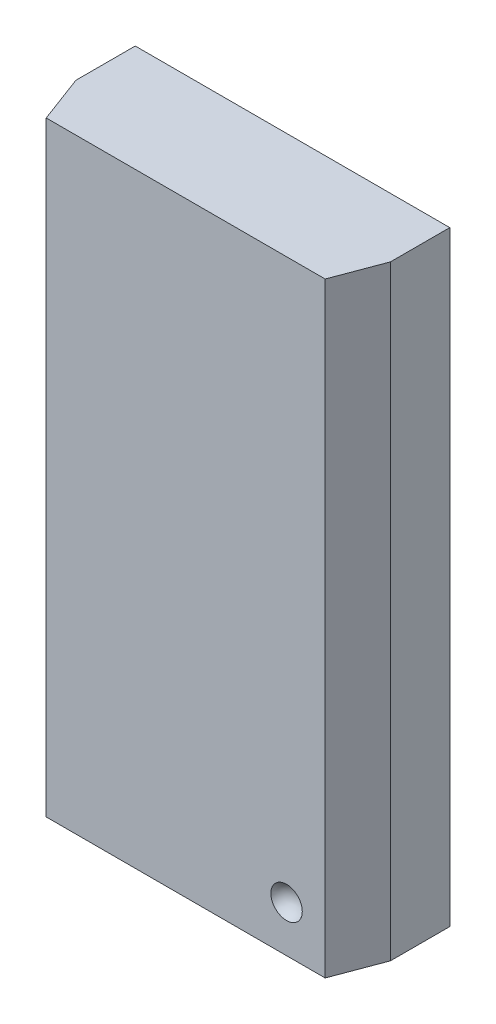
ISO-10303-21;
HEADER;
FILE_DESCRIPTION(('STEP AP214'),'2;1');
FILE_NAME('part.step','',(''),(''),'','','');
FILE_SCHEMA(('AUTOMOTIVE_DESIGN { 1 0 10303 214 1 1 1 1 }'));
ENDSEC;
DATA;
#1=APPLICATION_CONTEXT('core data for automotive mechanical design processes');
#2=APPLICATION_PROTOCOL_DEFINITION('international standard','automotive_design',2000,#1);
#3=PRODUCT_CONTEXT('',#1,'mechanical');
#4=PRODUCT('Part','Part','',(#3));
#5=PRODUCT_RELATED_PRODUCT_CATEGORY('part','',(#4));
#6=PRODUCT_DEFINITION_FORMATION('','',#4);
#7=PRODUCT_DEFINITION_CONTEXT('part definition',#1,'design');
#8=PRODUCT_DEFINITION('design','',#6,#7);
#9=PRODUCT_DEFINITION_SHAPE('','',#8);
#10=(LENGTH_UNIT() NAMED_UNIT(*) SI_UNIT(.MILLI.,.METRE.));
#11=(NAMED_UNIT(*) PLANE_ANGLE_UNIT() SI_UNIT($,.RADIAN.));
#12=(NAMED_UNIT(*) SI_UNIT($,.STERADIAN.) SOLID_ANGLE_UNIT());
#13=UNCERTAINTY_MEASURE_WITH_UNIT(LENGTH_MEASURE(1.E-05),#10,'distance_accuracy_value','');
#14=(GEOMETRIC_REPRESENTATION_CONTEXT(3) GLOBAL_UNCERTAINTY_ASSIGNED_CONTEXT((#13)) GLOBAL_UNIT_ASSIGNED_CONTEXT((#10,
#11,#12)) REPRESENTATION_CONTEXT('',''));
#15=CARTESIAN_POINT('',(0.,0.,0.));
#16=DIRECTION('',(0.,0.,1.));
#17=DIRECTION('',(1.,0.,0.));
#18=AXIS2_PLACEMENT_3D('',#15,#16,#17);
#19=CARTESIAN_POINT('',(1.59694277202488,-4.58817753292736,1.87268785101428));
#20=CARTESIAN_POINT('',(1.64216718875779,-4.58817753292736,1.76585007048859));
#21=CARTESIAN_POINT('',(1.75818245081433,-4.58817753292736,1.7659849276044));
#22=CARTESIAN_POINT('',(1.8031583674009,-4.58817753292736,1.87292755775573));
#23=CARTESIAN_POINT('',(1.34005004997247,-4.47097835084961,1.76394519967328));
#24=CARTESIAN_POINT('',(1.49800623473388,-4.47097835084961,1.39079084148934));
#25=CARTESIAN_POINT('',(1.90321495808281,-4.47097835084961,1.39126185951542));
#26=CARTESIAN_POINT('',(2.06030320163315,-4.47097835084961,1.764782427991));
#27=CARTESIAN_POINT('',(1.34156158465533,-4.16840308910263,1.76458503208151));
#28=CARTESIAN_POINT('',(1.498854465389,-4.16840308910263,1.39299765773633));
#29=CARTESIAN_POINT('',(1.90236159928336,-4.16840308910263,1.39346669782052));
#30=CARTESIAN_POINT('',(2.05879018354391,-4.16840308910263,1.76541874463367));
#31=CARTESIAN_POINT('',(1.59961010586653,-4.05423726383752,1.87381693303589));
#32=CARTESIAN_POINT('',(1.64366402131981,-4.05423726383752,1.76974433485755));
#33=CARTESIAN_POINT('',(1.75667656885828,-4.05423726383752,1.76987570159276));
#34=CARTESIAN_POINT('',(1.80048841586208,-4.05423726383752,1.87405043567195));
#35=(BOUNDED_SURFACE() B_SPLINE_SURFACE(3,3,((#19,#20,#21,#22),(#23,#24,#25,#26),(#27,#28,#29,
#30),(#31,#32,#33,#34)),.UNSPECIFIED.,.F.,.F.,.F.) B_SPLINE_SURFACE_WITH_KNOTS((4,4),(4,4),(0.,
1.),(0.,1.),.UNSPECIFIED.) GEOMETRIC_REPRESENTATION_ITEM() RATIONAL_B_SPLINE_SURFACE(((1.,
0.592495595609752,0.592495595609752,1.),(0.588217584838267,0.348516328276879,0.348516328276879,
0.588217584838267),(0.588217584838267,0.348516328276879,0.348516328276879,0.588217584838267),
(1.,0.592495595609752,0.592495595609752,1.))) REPRESENTATION_ITEM('') SURFACE());
#36=CARTESIAN_POINT('',(1.96447842560012,-4.32171313154078,1.80000000000028));
#37=CARTESIAN_POINT('',(1.96447728753263,-4.31838963170653,1.80000001262232));
#38=CARTESIAN_POINT('',(1.96441451224342,-4.315066139045,1.80000245878868));
#39=CARTESIAN_POINT('',(1.96416669474467,-4.3084576558505,1.8000110646047));
#40=CARTESIAN_POINT('',(1.96398290552865,-4.30517261821554,1.80001718614244));
#41=CARTESIAN_POINT('',(1.9634966485052,-4.29864656048071,1.80003195548272));
#42=CARTESIAN_POINT('',(1.9631954669972,-4.29540544451496,1.80004057565314));
#43=CARTESIAN_POINT('',(1.96247839642698,-4.2889723613424,1.80005930785607));
#44=CARTESIAN_POINT('',(1.96206381806036,-4.28578024798487,1.8000694022622));
#45=CARTESIAN_POINT('',(1.96112419202656,-4.27944988685185,1.80009017662881));
#46=CARTESIAN_POINT('',(1.9606004714086,-4.27631144207713,1.80010084850801));
#47=CARTESIAN_POINT('',(1.95944703881737,-4.27009271396852,1.80012200407324));
#48=CARTESIAN_POINT('',(1.95881866225767,-4.26701218294202,1.80013248848755));
#49=CARTESIAN_POINT('',(1.95746058554247,-4.26091315063053,1.80015262353895));
#50=CARTESIAN_POINT('',(1.95673222157607,-4.25789435183175,1.80016228281985));
#51=CARTESIAN_POINT('',(1.95517898520179,-4.25192222399201,1.80018024710359));
#52=CARTESIAN_POINT('',(1.95435544258135,-4.24896854912622,1.80018856761889));
#53=CARTESIAN_POINT('',(1.95261676925393,-4.24312968404578,1.80020345465584));
#54=CARTESIAN_POINT('',(1.95170295525224,-4.24024410177595,1.80021004239447));
#55=CARTESIAN_POINT('',(1.94978872518747,-4.23454401874528,1.80022118025014));
#56=CARTESIAN_POINT('',(1.94878960661037,-4.23172908227304,1.80022575603369));
#57=CARTESIAN_POINT('',(1.94670978201727,-4.22617248013593,1.80023269727542));
#58=CARTESIAN_POINT('',(1.94563034871328,-4.223430338093,1.80023509153108));
#59=CARTESIAN_POINT('',(1.94339490367646,-4.21802112001746,1.80023760246911));
#60=CARTESIAN_POINT('',(1.94224013493323,-4.21535353026608,1.80023774972271));
#61=CARTESIAN_POINT('',(1.93985899118724,-4.21009483384692,1.80023579918783));
#62=CARTESIAN_POINT('',(1.93863382512152,-4.20750317970491,1.80023373237143));
#63=CARTESIAN_POINT('',(1.93611679404825,-4.20239741159925,1.80022748021666));
#64=CARTESIAN_POINT('',(1.93482610021238,-4.1998827201745,1.8002233248835));
#65=CARTESIAN_POINT('',(1.93218283093036,-4.19493159408113,1.80021311041599));
#66=CARTESIAN_POINT('',(1.93083138578946,-4.19249455585088,1.80020707897545));
#67=CARTESIAN_POINT('',(1.92807132043073,-4.18769913420764,1.80019340941177));
#68=CARTESIAN_POINT('',(1.92666378712757,-4.18534012505309,1.80018579536664));
#69=CARTESIAN_POINT('',(1.9237961193707,-4.18070085929119,1.80016933471427));
#70=CARTESIAN_POINT('',(1.92233702652648,-4.17841995872413,1.80016050731443));
#71=CARTESIAN_POINT('',(1.91937067737575,-4.17393674337793,1.80014206485633));
#72=CARTESIAN_POINT('',(1.91786441582027,-4.17173377012607,1.80013246295508));
#73=CARTESIAN_POINT('',(1.91480797477914,-4.16740595164748,1.80011298488993));
#74=CARTESIAN_POINT('',(1.91325874274912,-4.16528043773412,1.80010311468349));
#75=CARTESIAN_POINT('',(1.91012056268004,-4.1611069910638,1.80008366639348));
#76=CARTESIAN_POINT('',(1.90853251253924,-4.15905838097272,1.80007408614963));
#77=CARTESIAN_POINT('',(1.9037492055295,-4.15307090281385,1.80004696250654));
#78=CARTESIAN_POINT('',(1.9004697469792,-4.14919853952155,1.80003056866547));
#79=CARTESIAN_POINT('',(1.89542693363786,-4.14357575552709,1.80001255333211));
#80=CARTESIAN_POINT('',(1.89374471934441,-4.14175171156943,1.80000766344338));
#81=CARTESIAN_POINT('',(1.89035527492868,-4.13817637272944,1.80000160317097));
#82=CARTESIAN_POINT('',(1.88864875193605,-4.13642440902473,1.80000038033407));
#83=CARTESIAN_POINT('',(1.88451028580023,-4.13229075578714,1.79999947064995));
#84=CARTESIAN_POINT('',(1.88205608843532,-4.12993128092376,1.80000057332496));
#85=CARTESIAN_POINT('',(1.87713750802628,-4.12538265832802,1.80000155337605));
#86=CARTESIAN_POINT('',(1.87467592457072,-4.12319048093511,1.80000146855918));
#87=CARTESIAN_POINT('',(1.86975121609557,-4.1189673874296,1.80000084045628));
#88=CARTESIAN_POINT('',(1.86729058158533,-4.11693356685693,1.80000031169454));
#89=CARTESIAN_POINT('',(1.86237476376204,-4.11301854762314,1.799998336808));
#90=CARTESIAN_POINT('',(1.85992179402098,-4.1111345689952,1.7999969197449));
#91=CARTESIAN_POINT('',(1.85502719520591,-4.10751052695507,1.79999318183108));
#92=CARTESIAN_POINT('',(1.85258752102228,-4.10576782278098,1.79999088999917));
#93=CARTESIAN_POINT('',(1.84772427137791,-4.10241780085942,1.79998544213194));
#94=CARTESIAN_POINT('',(1.84530241379946,-4.10080798874107,1.79998231412484));
#95=CARTESIAN_POINT('',(1.84047854357534,-4.0977154315357,1.79997536888789));
#96=CARTESIAN_POINT('',(1.83807803203342,-4.0962303444771,1.79997157456206));
#97=CARTESIAN_POINT('',(1.83329966578405,-4.09337919888772,1.79996356439305));
#98=CARTESIAN_POINT('',(1.83092311512417,-4.09201095432036,1.79995936364479));
#99=CARTESIAN_POINT('',(1.8261946398181,-4.08938575800985,1.79995095309825));
#100=CARTESIAN_POINT('',(1.82384384070561,-4.08812677859218,1.79994674673807));
#101=CARTESIAN_POINT('',(1.81916805227835,-4.08571277592795,1.79993872977672));
#102=CARTESIAN_POINT('',(1.81684402807039,-4.08455588263353,1.79993491164497));
#103=CARTESIAN_POINT('',(1.81222234094477,-4.08233890350286,1.79992863276084));
#104=CARTESIAN_POINT('',(1.80992549767243,-4.08127710937289,1.79992614012346));
#105=CARTESIAN_POINT('',(1.80535788353773,-4.07924421318437,1.79992204544429));
#106=CARTESIAN_POINT('',(1.80308780760194,-4.07827154720477,1.79992042348522));
#107=CARTESIAN_POINT('',(1.79767722141134,-4.07603892870223,1.79992395033207));
#108=CARTESIAN_POINT('',(1.79452555793486,-4.07480590976565,1.79993182768706));
#109=CARTESIAN_POINT('',(1.78832135571542,-4.07250902178397,1.79995986005971));
#110=CARTESIAN_POINT('',(1.78527070095982,-4.07144004977876,1.79997944928028));
#111=CARTESIAN_POINT('',(1.77926114532082,-4.06945481262306,1.80002289724225));
#112=CARTESIAN_POINT('',(1.77630373527828,-4.06853403365823,1.80004654343802));
#113=CARTESIAN_POINT('',(1.77047155045215,-4.06682990116505,1.80009308249294));
#114=CARTESIAN_POINT('',(1.76759791445186,-4.06604265108598,1.80011596977191));
#115=CARTESIAN_POINT('',(1.76192214840442,-4.06459236489603,1.80015653783994));
#116=CARTESIAN_POINT('',(1.75912085918034,-4.06392604443716,1.80017436770419));
#117=CARTESIAN_POINT('',(1.75357701922797,-4.06270611670374,1.8002017691248));
#118=CARTESIAN_POINT('',(1.75083505524894,-4.06214984915314,1.80021156051204));
#119=CARTESIAN_POINT('',(1.74539565653581,-4.06114019875331,1.80022126659007));
#120=CARTESIAN_POINT('',(1.74269859786264,-4.06068479268409,1.80022139732943));
#121=CARTESIAN_POINT('',(1.73733362606573,-4.05986859977837,1.80021183660787));
#122=CARTESIAN_POINT('',(1.73466592169933,-4.05950643744284,1.80020229959591));
#123=CARTESIAN_POINT('',(1.72934330190236,-4.05886996706827,1.80017528499996));
#124=CARTESIAN_POINT('',(1.72668847319052,-4.05859493174945,1.80015787626315));
#125=CARTESIAN_POINT('',(1.72137479716266,-4.05812736678646,1.80011903670423));
#126=CARTESIAN_POINT('',(1.71871595796997,-4.05793474269773,1.80009761052691));
#127=CARTESIAN_POINT('',(1.71066270682943,-4.05747230425462,1.80003575752337));
#128=CARTESIAN_POINT('',(1.70526059375794,-4.05732607517216,1.79999839177467));
#129=CARTESIAN_POINT('',(1.69714409821811,-4.05732929088231,1.80000080856573));
#130=CARTESIAN_POINT('',(1.69442890419356,-4.0573678709316,1.80001146884006));
#131=CARTESIAN_POINT('',(1.68903582681769,-4.05752354232483,1.80004183839399));
#132=CARTESIAN_POINT('',(1.68635791544734,-4.05763961093691,1.8000614287551));
#133=CARTESIAN_POINT('',(1.68102228660717,-4.05795167921069,1.80010164870628));
#134=CARTESIAN_POINT('',(1.67836454181789,-4.05814721347308,1.80012227164261));
#135=CARTESIAN_POINT('',(1.67305176164835,-4.05862101435347,1.80015873061526));
#136=CARTESIAN_POINT('',(1.67039673878764,-4.05889942266967,1.80017455835846));
#137=CARTESIAN_POINT('',(1.66507221024387,-4.05954309771667,1.80019791781358));
#138=CARTESIAN_POINT('',(1.66240279857298,-4.05990914596882,1.80020537123295));
#139=CARTESIAN_POINT('',(1.65703284961224,-4.06073365587095,1.80021049151079));
#140=CARTESIAN_POINT('',(1.6543325323709,-4.06119355231965,1.80020799365786));
#141=CARTESIAN_POINT('',(1.64888499593244,-4.06221282384361,1.80019351148227));
#142=CARTESIAN_POINT('',(1.64613816767734,-4.06277428452413,1.80018130538614));
#143=CARTESIAN_POINT('',(1.64058295767311,-4.06400535291193,1.80014925564922));
#144=CARTESIAN_POINT('',(1.63777518124051,-4.06467768503301,1.80012919522766));
#145=CARTESIAN_POINT('',(1.63208480150131,-4.06614088111347,1.80008456447886));
#146=CARTESIAN_POINT('',(1.62920306110645,-4.06693509465666,1.80005985980988));
#147=CARTESIAN_POINT('',(1.62335305577725,-4.06865418640755,1.80001031015964));
#148=CARTESIAN_POINT('',(1.62038595530577,-4.06958302727127,1.79998549928012));
#149=CARTESIAN_POINT('',(1.61435547054442,-4.07158560234113,1.79994052693302));
#150=CARTESIAN_POINT('',(1.61129360726477,-4.07266391865996,1.79992061861967));
#151=CARTESIAN_POINT('',(1.60506550193075,-4.07498083763565,1.79989311314443));
#152=CARTESIAN_POINT('',(1.60190117780547,-4.07622461082871,1.79988614320591));
#153=CARTESIAN_POINT('',(1.59648540020566,-4.07846973472313,1.79988483599233));
#154=CARTESIAN_POINT('',(1.59422248717997,-4.07944354301104,1.79988754888633));
#155=CARTESIAN_POINT('',(1.58966967613673,-4.08147828097116,1.79989376927941));
#156=CARTESIAN_POINT('',(1.58738046818964,-4.0825407572344,1.79989729456166));
#157=CARTESIAN_POINT('',(1.58277454746101,-4.08475854376306,1.79990567981732));
#158=CARTESIAN_POINT('',(1.58045864732798,-4.08591554128294,1.79991057185992));
#159=CARTESIAN_POINT('',(1.57579963494365,-4.08832912603591,1.79992074365444));
#160=CARTESIAN_POINT('',(1.5734574788928,-4.08958755973857,1.79992603031154));
#161=CARTESIAN_POINT('',(1.56874683390395,-4.09221094549689,1.79993660896536));
#162=CARTESIAN_POINT('',(1.5663794591953,-4.09357789867174,1.79994189692444));
#163=CARTESIAN_POINT('',(1.56161999585176,-4.09642564508946,1.79995207839219));
#164=CARTESIAN_POINT('',(1.55922919723553,-4.09790859488301,1.79995695591667));
#165=CARTESIAN_POINT('',(1.55442529737623,-4.10099595441502,1.79996605547793));
#166=CARTESIAN_POINT('',(1.55201368006104,-4.1026026736421,1.79997025345021));
#167=CARTESIAN_POINT('',(1.54717143443027,-4.10594547226463,1.7999778184759));
#168=CARTESIAN_POINT('',(1.54474250322951,-4.10768401055478,1.79998115599757));
#169=CARTESIAN_POINT('',(1.5398698762256,-4.11129856183645,1.799986950636));
#170=CARTESIAN_POINT('',(1.5374281104735,-4.11317717716404,1.79998937682664));
#171=CARTESIAN_POINT('',(1.5325351297735,-4.11708018295801,1.79999332326076));
#172=CARTESIAN_POINT('',(1.53008609896134,-4.11910731209517,1.79999481212983));
#173=CARTESIAN_POINT('',(1.5251849503557,-4.12331560548431,1.79999729563158));
#174=CARTESIAN_POINT('',(1.52273528856143,-4.12549963028503,1.79999827274461));
#175=CARTESIAN_POINT('',(1.5178407995044,-4.13003039083344,1.79999901095117));
#176=CARTESIAN_POINT('',(1.51539873148983,-4.13238010964625,1.79999873137773));
#177=CARTESIAN_POINT('',(1.51127326241243,-4.13650347924656,1.80000091530177));
#178=CARTESIAN_POINT('',(1.50956798925599,-4.13825531018738,1.80000263651959));
#179=CARTESIAN_POINT('',(1.50618103220596,-4.14183039596865,1.80000960561245));
#180=CARTESIAN_POINT('',(1.50450005663239,-4.1436543202939,1.80001490462973));
#181=CARTESIAN_POINT('',(1.49946089847525,-4.14927683078986,1.80003404257166));
#182=CARTESIAN_POINT('',(1.49618386897366,-4.1531490017354,1.80005102156798));
#183=CARTESIAN_POINT('',(1.49140417251879,-4.15913616979222,1.80007882032973));
#184=CARTESIAN_POINT('',(1.48981730583152,-4.16118471045469,1.8000885929689));
#185=CARTESIAN_POINT('',(1.48668146975714,-4.16535803991047,1.80010836508766));
#186=CARTESIAN_POINT('',(1.48513339991387,-4.16748350679634,1.80011836579036));
#187=CARTESIAN_POINT('',(1.48207925968156,-4.17181125565791,1.80013804911542));
#188=CARTESIAN_POINT('',(1.48057413852108,-4.17401420708135,1.80014772491975));
#189=CARTESIAN_POINT('',(1.47761004649529,-4.17849740599365,1.80016626492453));
#190=CARTESIAN_POINT('',(1.47615207227674,-4.18077831271362,1.80017511518855));
#191=CARTESIAN_POINT('',(1.47328661857439,-4.18541762072762,1.80019157679115));
#192=CARTESIAN_POINT('',(1.47188018271757,-4.18777666672655,1.80019916822538));
#193=CARTESIAN_POINT('',(1.46912229007704,-4.19257219462987,1.80021275333397));
#194=CARTESIAN_POINT('',(1.46777192234372,-4.19500930299874,1.80021872231783));
#195=CARTESIAN_POINT('',(1.46513078727063,-4.19996060441943,1.80022877822308));
#196=CARTESIAN_POINT('',(1.46384115248563,-4.20247540172409,1.80023283692406));
#197=CARTESIAN_POINT('',(1.46132622100579,-4.20758141892366,1.80023886778711));
#198=CARTESIAN_POINT('',(1.46010209784018,-4.21017321692998,1.80024080950442));
#199=CARTESIAN_POINT('',(1.45772302399344,-4.21543224044864,1.80024248746371));
#200=CARTESIAN_POINT('',(1.4565692847078,-4.21810001403567,1.8002421923818));
#201=CARTESIAN_POINT('',(1.45433588577539,-4.22350964088882,1.80023936908035));
#202=CARTESIAN_POINT('',(1.45325747166909,-4.2262520084157,1.80023681002573));
#203=CARTESIAN_POINT('',(1.45117967620034,-4.23180910400533,1.80022952816153));
#204=CARTESIAN_POINT('',(1.45018157018332,-4.23462430892148,1.80022477637817));
#205=CARTESIAN_POINT('',(1.44826935991668,-4.24032497228982,1.80021328118225));
#206=CARTESIAN_POINT('',(1.44735655585767,-4.24321086685451,1.80020651201345));
#207=CARTESIAN_POINT('',(1.44561990140368,-4.24905040047124,1.80019126244977));
#208=CARTESIAN_POINT('',(1.44479737047707,-4.25200443189854,1.80018276083307));
#209=CARTESIAN_POINT('',(1.44324616109355,-4.25797731678278,1.80016444033198));
#210=CARTESIAN_POINT('',(1.44251881523156,-4.26099651629769,1.80015460601279));
#211=CARTESIAN_POINT('',(1.44116278318394,-4.26709639336605,1.80013413248553));
#212=CARTESIAN_POINT('',(1.44053543602389,-4.27017736857464,1.80012348479066));
#213=CARTESIAN_POINT('',(1.43938407571509,-4.27639702715858,1.80010201982696));
#214=CARTESIAN_POINT('',(1.43886140082878,-4.27953595827253,1.8000912020623));
#215=CARTESIAN_POINT('',(1.43792388485362,-4.28586733232517,1.80007015858106));
#216=CARTESIAN_POINT('',(1.43751037365755,-4.28905997221157,1.80005994124898));
#217=CARTESIAN_POINT('',(1.43679546114087,-4.29549414613043,1.80004099124499));
#218=CARTESIAN_POINT('',(1.43649537333551,-4.2987358261641,1.80003227656784));
#219=CARTESIAN_POINT('',(1.43601133244496,-4.30526304644892,1.80001735158137));
#220=CARTESIAN_POINT('',(1.43582866843597,-4.30854868231947,1.80001116933172));
#221=CARTESIAN_POINT('',(1.43558313494502,-4.31515839246057,1.80000248051373));
#222=CARTESIAN_POINT('',(1.43552152117018,-4.31848251349361,1.80000001253604));
#223=CARTESIAN_POINT('',(1.43552155787678,-4.32180661986832,1.8));
#224=B_SPLINE_CURVE_WITH_KNOTS('',3,(#36,#37,#38,#39,#40,#41,#42,#43,#44,#45,#46,#47,#48,#49,
#50,#51,#52,#53,#54,#55,#56,#57,#58,#59,#60,#61,#62,#63,#64,#65,#66,#67,#68,#69,#70,#71,#72,#73,
#74,#75,#76,#77,#78,#79,#80,#81,#82,#83,#84,#85,#86,#87,#88,#89,#90,#91,#92,#93,#94,#95,#96,#97,
#98,#99,#100,#101,#102,#103,#104,#105,#106,#107,#108,#109,#110,#111,#112,#113,#114,#115,#116,
#117,#118,#119,#120,#121,#122,#123,#124,#125,#126,#127,#128,#129,#130,#131,#132,#133,#134,#135,
#136,#137,#138,#139,#140,#141,#142,#143,#144,#145,#146,#147,#148,#149,#150,#151,#152,#153,#154,
#155,#156,#157,#158,#159,#160,#161,#162,#163,#164,#165,#166,#167,#168,#169,#170,#171,#172,#173,
#174,#175,#176,#177,#178,#179,#180,#181,#182,#183,#184,#185,#186,#187,#188,#189,#190,#191,#192,
#193,#194,#195,#196,#197,#198,#199,#200,#201,#202,#203,#204,#205,#206,#207,#208,#209,#210,#211,
#212,#213,#214,#215,#216,#217,#218,#219,#220,#221,#222,#223),.UNSPECIFIED.,.F.,.F.,(4,2,2,2,2,2,
2,2,2,2,2,2,2,2,2,2,2,2,2,2,2,2,2,2,2,2,2,2,2,2,2,2,2,2,2,2,2,2,2,2,2,2,2,2,2,2,2,2,2,2,2,2,2,2,
2,2,2,2,2,2,2,2,2,2,2,2,2,2,2,2,2,2,2,2,2,2,2,2,2,2,2,2,2,2,2,2,2,2,2,2,2,2,2,4),(0.,
0.00996994681120313,0.019838253441854,0.0296013397239781,0.0392560289543843,0.0487995424984408,
0.0582294920678693,0.0675438698751125,0.0767410368790987,0.0858197093447432,0.0947789439411366,
0.103618121601944,0.112336930366164,0.120935347408863,0.129413620460281,0.137772248798198,
0.146011963983612,0.154133710493544,0.162138626388273,0.170028024133283,0.177803371679677,
0.193016908437267,0.200460191912681,0.207796486982701,0.218007163549384,0.227893515312357,
0.237468482098441,0.246745462892873,0.255738230581652,0.264460860901396,0.272927673937384,
0.281153186372725,0.289152072595428,0.296939132709026,0.304529265464787,0.311937444141061,
0.322087875523131,0.331783608526317,0.341074301877529,0.350011398957019,0.358648268159855,
0.367040236703196,0.375244471001956,0.383319670991557,0.391325570830822,0.399322271046716,
0.415523880562741,0.423669546475451,0.431709773076741,0.439703574637635,0.447711123299363,
0.455792928232914,0.464009052714694,0.47241844981339,0.481078473062177,0.490044584795218,
0.499370251840517,0.509106993557923,0.519304533681003,0.526694330460224,0.534264549497014,
0.542029953555879,0.550005232628826,0.558204979754266,0.56664366395271,0.575335598372119,
0.584294901727865,0.593535451148659,0.603070824598738,0.612914231139826,0.623078427429811,
0.630411821343745,0.637852324851061,0.653060719734916,0.660833730305263,0.668720962527806,
0.676723894866757,0.684843849447076,0.693081973117237,0.701439218252697,0.709916323403845,
0.71851379390894,0.727231882609509,0.736070570822401,0.745029549738859,0.754108202436034,
0.763305586699844,0.772620418869388,0.78205105892176,0.791595497021435,0.801251341760002,
0.811015810309253,0.820885720703263,0.830857486452704),.UNSPECIFIED.);
#225=CARTESIAN_POINT('',(1.43552155787679,-4.32180661986832,1.8));
#226=VERTEX_POINT('',#225);
#227=CARTESIAN_POINT('',(1.96447842560009,-4.32171313154078,1.80000000000029));
#228=VERTEX_POINT('',#227);
#229=EDGE_CURVE('E29',#226,#228,#224,.F.);
#230=CARTESIAN_POINT('',(1.43552155787678,-4.32180661986832,1.8));
#231=CARTESIAN_POINT('',(1.43552152097319,-4.32513432538533,1.80000001267427));
#232=CARTESIAN_POINT('',(1.43558326769948,-4.32846204569287,1.80000248739306));
#233=CARTESIAN_POINT('',(1.4358293270654,-4.33507873426998,1.80001119428601));
#234=CARTESIAN_POINT('',(1.43601237505861,-4.33836774968633,1.80001738762909));
#235=CARTESIAN_POINT('',(1.43649742070393,-4.3449015112318,1.80003233089996));
#236=CARTESIAN_POINT('',(1.43679812096634,-4.3481463536997,1.80004105268286));
#237=CARTESIAN_POINT('',(1.43751447305908,-4.35458663929645,1.80006000639251));
#238=CARTESIAN_POINT('',(1.43792880373481,-4.35778222943113,1.80007022036798));
#239=CARTESIAN_POINT('',(1.43886815286966,-4.36411929761219,1.80009124161053));
#240=CARTESIAN_POINT('',(1.43939183450041,-4.36726097384147,1.80010204064106));
#241=CARTESIAN_POINT('',(1.4405453837761,-4.37348592493878,1.80012344918974));
#242=CARTESIAN_POINT('',(1.44117390694686,-4.37656944895573,1.80013405942999));
#243=CARTESIAN_POINT('',(1.44253244965572,-4.38267423609217,1.80015443720018));
#244=CARTESIAN_POINT('',(1.44326112468904,-4.3856957983967,1.80016421349526));
#245=CARTESIAN_POINT('',(1.44481513616297,-4.3916732326816,1.80018239665995));
#246=CARTESIAN_POINT('',(1.44563913526066,-4.39462945231522,1.80019081926859));
#247=CARTESIAN_POINT('',(1.44737885688156,-4.40047319843592,1.80020589048073));
#248=CARTESIAN_POINT('',(1.44829325590886,-4.40336111890712,1.80021256061058));
#249=CARTESIAN_POINT('',(1.45020877596077,-4.4090656830641,1.80022383967242));
#250=CARTESIAN_POINT('',(1.45120859346857,-4.41188276443623,1.80022847464085));
#251=CARTESIAN_POINT('',(1.45328992267876,-4.4174434751478,1.80023550835844));
#252=CARTESIAN_POINT('',(1.45437015638431,-4.42018758283492,1.80023793631399));
#253=CARTESIAN_POINT('',(1.45660729798064,-4.42560056556223,1.8002404876359));
#254=CARTESIAN_POINT('',(1.45776295832147,-4.42826995623803,1.80024064200068));
#255=CARTESIAN_POINT('',(1.46014597212308,-4.43353210272615,1.80023867869577));
#256=CARTESIAN_POINT('',(1.4613721127828,-4.43612540783378,1.80023659242412));
#257=CARTESIAN_POINT('',(1.46389117300388,-4.44123434097287,1.80023027548781));
#258=CARTESIAN_POINT('',(1.46518291819223,-4.44375054815258,1.80022607523493));
#259=CARTESIAN_POINT('',(1.46782836510138,-4.44870458355194,1.80021574723172));
#260=CARTESIAN_POINT('',(1.46918093394014,-4.45114301685343,1.80020964754578));
#261=CARTESIAN_POINT('',(1.47194331828773,-4.45594112075385,1.80019582098148));
#262=CARTESIAN_POINT('',(1.47335204488807,-4.45830141841996,1.80018811850079));
#263=CARTESIAN_POINT('',(1.47622216904998,-4.46294316711299,1.80017146463114));
#264=CARTESIAN_POINT('',(1.4776825235471,-4.46522526320816,1.80016253270509));
#265=CARTESIAN_POINT('',(1.48065146537735,-4.4697107886347,1.80014386994639));
#266=CARTESIAN_POINT('',(1.48215905699796,-4.47191487731331,1.80013415245072));
#267=CARTESIAN_POINT('',(1.48521822834536,-4.47624485809093,1.8001144379881));
#268=CARTESIAN_POINT('',(1.48676886010143,-4.47837141950427,1.80010444707289));
#269=CARTESIAN_POINT('',(1.4899099113551,-4.48254690395793,1.80008475898065));
#270=CARTESIAN_POINT('',(1.49149943284125,-4.48459650470788,1.80007505964528));
#271=CARTESIAN_POINT('',(1.496287289141,-4.49058693471223,1.80004759543006));
#272=CARTESIAN_POINT('',(1.49956992439577,-4.49446115110618,1.80003099181776));
#273=CARTESIAN_POINT('',(1.50461769909944,-4.50008655689535,1.80001273859129));
#274=CARTESIAN_POINT('',(1.50630161978328,-4.5019114794039,1.80000778248215));
#275=CARTESIAN_POINT('',(1.50969455997794,-4.50548855827283,1.80000163552276));
#276=CARTESIAN_POINT('',(1.51140287342483,-4.50724138279531,1.80000039170414));
#277=CARTESIAN_POINT('',(1.51553082893489,-4.51136216706215,1.79999945818449));
#278=CARTESIAN_POINT('',(1.5179721837813,-4.51370843873857,1.80000054673255));
#279=CARTESIAN_POINT('',(1.52286476628212,-4.51823228887475,1.80000146814371));
#280=CARTESIAN_POINT('',(1.52531323202504,-4.52041285663595,1.80000133968678));
#281=CARTESIAN_POINT('',(1.5302115511035,-4.52461429103726,1.80000060452193));
#282=CARTESIAN_POINT('',(1.53265894760361,-4.52663802221899,1.80000001295515));
#283=CARTESIAN_POINT('',(1.53754827549218,-4.53053433797172,1.79999789510872));
#284=CARTESIAN_POINT('',(1.53998802300862,-4.53240966351743,1.79999639838259));
#285=CARTESIAN_POINT('',(1.54485627936588,-4.5360177834461,1.79999248996039));
#286=CARTESIAN_POINT('',(1.54728285926982,-4.53775318094526,1.79999010757889));
#287=CARTESIAN_POINT('',(1.5521201165528,-4.54108987855153,1.7999844742445));
#288=CARTESIAN_POINT('',(1.55452909848761,-4.54269363706971,1.79998125140382));
#289=CARTESIAN_POINT('',(1.55932748684203,-4.54577527985899,1.7999741202389));
#290=CARTESIAN_POINT('',(1.56171541134157,-4.54725547210459,1.79997023467531));
#291=CARTESIAN_POINT('',(1.56646892642688,-4.55009792543229,1.79996205491986));
#292=CARTESIAN_POINT('',(1.56883322916371,-4.5514623407359,1.79995777544546));
#293=CARTESIAN_POINT('',(1.57353756663875,-4.5540808826757,1.79994922966596));
#294=CARTESIAN_POINT('',(1.57587648932321,-4.55533700753773,1.79994496621702));
#295=CARTESIAN_POINT('',(1.58052890045872,-4.55774621637886,1.79993686849502));
#296=CARTESIAN_POINT('',(1.58284143483715,-4.55890114344169,1.79993302587276));
#297=CARTESIAN_POINT('',(1.58744052035064,-4.56111501880382,1.79992673645168));
#298=CARTESIAN_POINT('',(1.58972626064903,-4.56217565111583,1.79992425695736));
#299=CARTESIAN_POINT('',(1.59427203085251,-4.56420697949101,1.79992025177554));
#300=CARTESIAN_POINT('',(1.59653137276788,-4.56517921769508,1.79991870474008));
#301=CARTESIAN_POINT('',(1.60195074647809,-4.56742573865287,1.79992244996481));
#302=CARTESIAN_POINT('',(1.60512240845642,-4.56867206844797,1.79993060700133));
#303=CARTESIAN_POINT('',(1.61136502483549,-4.57099292939248,1.79995936963017));
#304=CARTESIAN_POINT('',(1.61443404347775,-4.57207268204904,1.79997939532237));
#305=CARTESIAN_POINT('',(1.62047885919581,-4.57407724979534,1.80002376939713));
#306=CARTESIAN_POINT('',(1.62345312616426,-4.57500667985488,1.80004789974941));
#307=CARTESIAN_POINT('',(1.62931771034982,-4.57672623479413,1.8000953602579));
#308=CARTESIAN_POINT('',(1.63220685992263,-4.57752034111219,1.80011868551931));
#309=CARTESIAN_POINT('',(1.63791252607849,-4.57898275570475,1.80016000751496));
#310=CARTESIAN_POINT('',(1.64072818136878,-4.57965441786958,1.80017815818125));
#311=CARTESIAN_POINT('',(1.6462998410123,-4.58088368980897,1.8002060288009));
#312=CARTESIAN_POINT('',(1.6490552449279,-4.5814440145929,1.80021597527091));
#313=CARTESIAN_POINT('',(1.65452084261402,-4.58246064075114,1.80022579741498));
#314=CARTESIAN_POINT('',(1.65723065209253,-4.58291900556383,1.80022589544995));
#315=CARTESIAN_POINT('',(1.66262070450881,-4.5837401365948,1.80021608216395));
#316=CARTESIAN_POINT('',(1.66530073433692,-4.5841043042999,1.80020632963953));
#317=CARTESIAN_POINT('',(1.67064780652612,-4.58474393345111,1.80017874447638));
#318=CARTESIAN_POINT('',(1.67331476094932,-4.58502013434806,1.80016098239925));
#319=CARTESIAN_POINT('',(1.67865289170187,-4.58548925727964,1.80012135223997));
#320=CARTESIAN_POINT('',(1.68132405985949,-4.5856822730307,1.80009948881848));
#321=CARTESIAN_POINT('',(1.68668811266144,-4.58598899210902,1.80005771411471));
#322=CARTESIAN_POINT('',(1.6893810267503,-4.58610217908085,1.80003781624485));
#323=CARTESIAN_POINT('',(1.69480595263072,-4.58625189048005,1.80000846474094));
#324=CARTESIAN_POINT('',(1.69753799442439,-4.58628734291903,1.79999915799195));
#325=CARTESIAN_POINT('',(1.70299403840541,-4.58628251248077,1.80000083955253));
#326=CARTESIAN_POINT('',(1.70571804080329,-4.58624245016787,1.80001176875504));
#327=CARTESIAN_POINT('',(1.71112837741411,-4.58608349189676,1.80004312625106));
#328=CARTESIAN_POINT('',(1.71381474218637,-4.58596562457593,1.80006342957318));
#329=CARTESIAN_POINT('',(1.71916716542638,-4.58564959776129,1.80010538953523));
#330=CARTESIAN_POINT('',(1.7218332514595,-4.58545190673351,1.80012703766613));
#331=CARTESIAN_POINT('',(1.72716263444485,-4.58497337450646,1.8001657616012));
#332=CARTESIAN_POINT('',(1.72982591870619,-4.58469239083012,1.80018282947445));
#333=CARTESIAN_POINT('',(1.73516698803792,-4.58404307632648,1.80020878762702));
#334=CARTESIAN_POINT('',(1.73784467792191,-4.5836739581849,1.80021760045215));
#335=CARTESIAN_POINT('',(1.74323128802325,-4.58284273136836,1.80022547302622));
#336=CARTESIAN_POINT('',(1.74593998531626,-4.58237917590263,1.80022436784045));
#337=CARTESIAN_POINT('',(1.75140447991301,-4.58135190110778,1.80021262705578));
#338=CARTESIAN_POINT('',(1.75415988092258,-4.58078607685138,1.80020176724644));
#339=CARTESIAN_POINT('',(1.75973252724918,-4.57954546516541,1.80017229576876));
#340=CARTESIAN_POINT('',(1.76254915838988,-4.57886792561502,1.80015346203103));
#341=CARTESIAN_POINT('',(1.76825762942475,-4.57739334081558,1.80011110460041));
#342=CARTESIAN_POINT('',(1.77114859286624,-4.57659290887118,1.80008743823798));
#343=CARTESIAN_POINT('',(1.77701751329715,-4.57486021949054,1.8000397277403));
#344=CARTESIAN_POINT('',(1.77999428629287,-4.57392395193012,1.80001570676104));
#345=CARTESIAN_POINT('',(1.7860446604718,-4.57190513569822,1.7999720102594));
#346=CARTESIAN_POINT('',(1.78911671341406,-4.57081794576793,1.79995257422038));
#347=CARTESIAN_POINT('',(1.79536581726574,-4.56848164588993,1.79992570373175));
#348=CARTESIAN_POINT('',(1.79854091418557,-4.56722729455829,1.79991888395619));
#349=CARTESIAN_POINT('',(1.80395701043236,-4.5649703215294,1.79991738559634));
#350=CARTESIAN_POINT('',(1.80620983803908,-4.56399597895876,1.79991983437787));
#351=CARTESIAN_POINT('',(1.81074299948721,-4.56196020265418,1.79992515631426));
#352=CARTESIAN_POINT('',(1.81302263463647,-4.5608972105032,1.79992803847043));
#353=CARTESIAN_POINT('',(1.81760994359583,-4.55867842384298,1.79993486537572));
#354=CARTESIAN_POINT('',(1.81991679578172,-4.55752093109858,1.7999388359004));
#355=CARTESIAN_POINT('',(1.82455825388781,-4.55510637342353,1.79994695734558));
#356=CARTESIAN_POINT('',(1.82689189403083,-4.55384745129524,1.79995111023015));
#357=CARTESIAN_POINT('',(1.83158605952237,-4.55122309158588,1.79995928601005));
#358=CARTESIAN_POINT('',(1.83394546048946,-4.54985564247942,1.79996330184441));
#359=CARTESIAN_POINT('',(1.83868954027044,-4.54700688685891,1.79997087229953));
#360=CARTESIAN_POINT('',(1.84107291825332,-4.54552341354432,1.79997440986105));
#361=CARTESIAN_POINT('',(1.84586255369526,-4.54243496432852,1.79998083168134));
#362=CARTESIAN_POINT('',(1.84826731566104,-4.54082766870868,1.79998369289306));
#363=CARTESIAN_POINT('',(1.85309644126734,-4.53748364333566,1.79998865597332));
#364=CARTESIAN_POINT('',(1.85551909534054,-4.53574444430465,1.79999073150748));
#365=CARTESIAN_POINT('',(1.86037977248523,-4.53212845915218,1.7999941429456));
#366=CARTESIAN_POINT('',(1.86281585198028,-4.53024905996199,1.79999545334111));
#367=CARTESIAN_POINT('',(1.86769807895406,-4.52634432962412,1.79999738396908));
#368=CARTESIAN_POINT('',(1.87014202751085,-4.52431624856467,1.79999798063395));
#369=CARTESIAN_POINT('',(1.87503363781956,-4.52010583644413,1.7999989549728));
#370=CARTESIAN_POINT('',(1.87747882710566,-4.51792063273755,1.79999932487989));
#371=CARTESIAN_POINT('',(1.88236502157469,-4.51338725458782,1.79999925271448));
#372=CARTESIAN_POINT('',(1.88480324960105,-4.51103608453497,1.79999878356396));
#373=CARTESIAN_POINT('',(1.88892206127071,-4.50691057544052,1.80000087758855));
#374=CARTESIAN_POINT('',(1.8906244998352,-4.50515799320957,1.80000263248977));
#375=CARTESIAN_POINT('',(1.89400565514393,-4.50158159959751,1.80000965746183));
#376=CARTESIAN_POINT('',(1.89568366653176,-4.49975712291536,1.8000149782971));
#377=CARTESIAN_POINT('',(1.90071356989135,-4.49413341457119,1.80003421122036));
#378=CARTESIAN_POINT('',(1.90398436680387,-4.49026080209281,1.80005129361724));
#379=CARTESIAN_POINT('',(1.90875464953577,-4.48427348136691,1.80007925461066));
#380=CARTESIAN_POINT('',(1.91033827966598,-4.48222505379526,1.80008908276362));
#381=CARTESIAN_POINT('',(1.91346758090457,-4.47805217595855,1.80010896753124));
#382=CARTESIAN_POINT('',(1.91501235599194,-4.47592705159235,1.80011902538348));
#383=CARTESIAN_POINT('',(1.91805986362052,-4.47160021419294,1.80013882047103));
#384=CARTESIAN_POINT('',(1.91956165049573,-4.4693978355317,1.80014855086335));
#385=CARTESIAN_POINT('',(1.92251905030563,-4.4649160082405,1.80016719483796));
#386=CARTESIAN_POINT('',(1.92397367015168,-4.46263590401452,1.80017609443503));
#387=CARTESIAN_POINT('',(1.92683241170761,-4.45799842462363,1.80019264703302));
#388=CARTESIAN_POINT('',(1.92823549330482,-4.45564040817594,1.8002002800538));
#389=CARTESIAN_POINT('',(1.93098669480167,-4.45084715846201,1.80021393876502));
#390=CARTESIAN_POINT('',(1.93233372907543,-4.44841130191912,1.80021993966519));
#391=CARTESIAN_POINT('',(1.9349682356894,-4.44346271642954,1.80023004840652));
#392=CARTESIAN_POINT('',(1.9362545787601,-4.44094938616417,1.80023412790607));
#393=CARTESIAN_POINT('',(1.93876298639542,-4.43584650617093,1.80024018844945));
#394=CARTESIAN_POINT('',(1.93998388052351,-4.4332563809968,1.8002421389099));
#395=CARTESIAN_POINT('',(1.94235657675798,-4.42800089469986,1.80024382202283));
#396=CARTESIAN_POINT('',(1.94350717031246,-4.42533498788755,1.80024352320041));
#397=CARTESIAN_POINT('',(1.94573437857235,-4.4199292721136,1.80024068018232));
#398=CARTESIAN_POINT('',(1.94680975027256,-4.41718895099059,1.80023810499443));
#399=CARTESIAN_POINT('',(1.94888158117192,-4.41163610925106,1.80023077924482));
#400=CARTESIAN_POINT('',(1.94987676719148,-4.40882311359457,1.80022599955353));
#401=CARTESIAN_POINT('',(1.95178327595063,-4.40312701087996,1.80021443806817));
#402=CARTESIAN_POINT('',(1.95269330023382,-4.40024346924289,1.80020763037214));
#403=CARTESIAN_POINT('',(1.95442455031896,-4.3944087623719,1.80019229496442));
#404=CARTESIAN_POINT('',(1.95524445789294,-4.39145720602924,1.80018374590523));
#405=CARTESIAN_POINT('',(1.95679059055873,-4.38548936875843,1.80016532396405));
#406=CARTESIAN_POINT('',(1.95751548374129,-4.38247274279169,1.80015543555285));
#407=CARTESIAN_POINT('',(1.95886679299766,-4.37637808480021,1.8001348500851));
#408=CARTESIAN_POINT('',(1.95949187011842,-4.37329975591971,1.80012414449097));
#409=CARTESIAN_POINT('',(1.96063888295129,-4.36708543472896,1.8001025633503));
#410=CARTESIAN_POINT('',(1.96115947980589,-4.36394919529392,1.80009168731422));
#411=CARTESIAN_POINT('',(1.96209303951832,-4.35762322060492,1.80007053088623));
#412=CARTESIAN_POINT('',(1.96250467117164,-4.35443328887307,1.80006025895659));
#413=CARTESIAN_POINT('',(1.96321602848646,-4.3480045173866,1.80004120794165));
#414=CARTESIAN_POINT('',(1.9635144385622,-4.34476553200474,1.80003244701558));
#415=CARTESIAN_POINT('',(1.96399532867798,-4.33824365652662,1.80001744293906));
#416=CARTESIAN_POINT('',(1.9641765167788,-4.33496067114363,1.80001122811501));
#417=CARTESIAN_POINT('',(1.96441930028038,-4.32835618647004,1.80000249342285));
#418=CARTESIAN_POINT('',(1.96447963629548,-4.32503464076636,1.80000001253123));
#419=CARTESIAN_POINT('',(1.96447842560012,-4.32171313154078,1.80000000000028));
#420=B_SPLINE_CURVE_WITH_KNOTS('',3,(#230,#231,#232,#233,#234,#235,#236,#237,#238,#239,#240,
#241,#242,#243,#244,#245,#246,#247,#248,#249,#250,#251,#252,#253,#254,#255,#256,#257,#258,#259,
#260,#261,#262,#263,#264,#265,#266,#267,#268,#269,#270,#271,#272,#273,#274,#275,#276,#277,#278,
#279,#280,#281,#282,#283,#284,#285,#286,#287,#288,#289,#290,#291,#292,#293,#294,#295,#296,#297,
#298,#299,#300,#301,#302,#303,#304,#305,#306,#307,#308,#309,#310,#311,#312,#313,#314,#315,#316,
#317,#318,#319,#320,#321,#322,#323,#324,#325,#326,#327,#328,#329,#330,#331,#332,#333,#334,#335,
#336,#337,#338,#339,#340,#341,#342,#343,#344,#345,#346,#347,#348,#349,#350,#351,#352,#353,#354,
#355,#356,#357,#358,#359,#360,#361,#362,#363,#364,#365,#366,#367,#368,#369,#370,#371,#372,#373,
#374,#375,#376,#377,#378,#379,#380,#381,#382,#383,#384,#385,#386,#387,#388,#389,#390,#391,#392,
#393,#394,#395,#396,#397,#398,#399,#400,#401,#402,#403,#404,#405,#406,#407,#408,#409,#410,#411,
#412,#413,#414,#415,#416,#417,#418,#419),.UNSPECIFIED.,.F.,.F.,(4,2,2,2,2,2,2,2,2,2,2,2,2,2,2,2,
2,2,2,2,2,2,2,2,2,2,2,2,2,2,2,2,2,2,2,2,2,2,2,2,2,2,2,2,2,2,2,2,2,2,2,2,2,2,2,2,2,2,2,2,2,2,2,2,
2,2,2,2,2,2,2,2,2,2,2,2,2,2,2,2,2,2,2,2,2,2,2,2,2,2,2,2,2,2,4),(0.,0.0099825614937767,
0.0198626519093181,0.0296367301590854,0.0393016618752575,0.0488547135698336,0.0582935444687611,
0.0676161962277926,0.076821080749539,0.0859069663278659,0.0948729623478409,0.103718502767337,
0.112443328600312,0.12104746961273,0.12953122543022,0.137895146242677,0.146140013275564,
0.154266819181279,0.162276748486881,0.170171158217391,0.177951558797076,0.193175480373888,
0.200624171681914,0.207966061676756,0.218121557534655,0.227955392550496,0.237480497393798,
0.246710236582489,0.255658325115786,0.264338758965596,0.272765757783011,0.280953718053732,
0.288917174853757,0.296670770308076,0.30422922683861,0.311607323304699,0.321828135019765,
0.331586531797967,0.340933205094917,0.349920605451381,0.358603091613316,0.367036971157432,
0.3752803842407,0.383392996789561,0.391435495325247,0.399468909340132,0.407553820696021,
0.415749542719716,0.423921363672303,0.431987254867983,0.440006481800013,0.448039506045175,
0.456147167775222,0.464389905087753,0.472827091189361,0.48151654629094,0.49051424737129,
0.499874225825606,0.509648618078945,0.519887820470201,0.527250477688391,0.534795314542531,
0.542537115015356,0.550490595871758,0.558670384150299,0.567090991578367,0.575766783997069,
0.584711943874094,0.593940424006956,0.603465890573844,0.613301653776936,0.623460584449766,
0.630789667880394,0.638225368807232,0.653422727786936,0.661189530265447,0.669070119962145,
0.677065997690776,0.685178511137042,0.693408835917337,0.701757956362035,0.710226646124928,
0.718815448737204,0.727524658241151,0.736354300055658,0.745304112241777,0.754373527351879,
0.763561655059654,0.772867265779861,0.782288775495825,0.79182423201848,0.801471302903,
0.811227265246976,0.821088997587485,0.831052974102795),.UNSPECIFIED.);
#421=EDGE_CURVE('E11',#228,#226,#420,.F.);
#422=ORIENTED_EDGE('',*,*,#229,.F.);
#423=ORIENTED_EDGE('',*,*,#421,.F.);
#424=EDGE_LOOP('',(#422,#423));
#425=FACE_BOUND('',#424,.T.);
#426=ADVANCED_FACE('F16',(#425),#35,.F.);
#427=CARTESIAN_POINT('',(2.35,0.,1.8));
#428=DIRECTION('',(0.936329177569045,0.,0.351123441588392));
#429=DIRECTION('',(0.,-1.,0.));
#430=AXIS2_PLACEMENT_3D('',#427,#428,#429);
#431=PLANE('',#430);
#432=DIRECTION('',(-0.351123441588392,0.,0.936329177569044));
#433=VECTOR('',#432,1.);
#434=CARTESIAN_POINT('',(2.35,5.1,1.8));
#435=LINE('',#434,#433);
#436=CARTESIAN_POINT('',(2.65,5.1,1.));
#437=VERTEX_POINT('',#436);
#438=CARTESIAN_POINT('',(2.35,5.1,1.8));
#439=VERTEX_POINT('',#438);
#440=EDGE_CURVE('E213',#437,#439,#435,.T.);
#441=ORIENTED_EDGE('',*,*,#440,.T.);
#442=DIRECTION('',(0.,1.,0.));
#443=VECTOR('',#442,1.);
#444=CARTESIAN_POINT('',(2.35,0.,1.8));
#445=LINE('',#444,#443);
#446=CARTESIAN_POINT('',(2.35,-5.1,1.8));
#447=VERTEX_POINT('',#446);
#448=EDGE_CURVE('E148',#447,#439,#445,.T.);
#449=ORIENTED_EDGE('',*,*,#448,.F.);
#450=DIRECTION('',(0.351123441588392,0.,-0.936329177569044));
#451=VECTOR('',#450,1.);
#452=CARTESIAN_POINT('',(2.35,-5.1,1.8));
#453=LINE('',#452,#451);
#454=CARTESIAN_POINT('',(2.65,-5.1,1.));
#455=VERTEX_POINT('',#454);
#456=EDGE_CURVE('E203',#447,#455,#453,.T.);
#457=ORIENTED_EDGE('',*,*,#456,.T.);
#458=DIRECTION('',(0.,1.,0.));
#459=VECTOR('',#458,1.);
#460=CARTESIAN_POINT('',(2.65,-5.1,1.));
#461=LINE('',#460,#459);
#462=EDGE_CURVE('E156',#455,#437,#461,.T.);
#463=ORIENTED_EDGE('',*,*,#462,.T.);
#464=EDGE_LOOP('',(#441,#449,#457,#463));
#465=FACE_BOUND('',#464,.T.);
#466=ADVANCED_FACE('F179',(#465),#431,.T.);
#467=CARTESIAN_POINT('',(0.,0.,1.8));
#468=DIRECTION('',(0.,0.,1.));
#469=DIRECTION('',(1.,0.,0.));
#470=AXIS2_PLACEMENT_3D('',#467,#468,#469);
#471=PLANE('',#470);
#472=ORIENTED_EDGE('',*,*,#229,.T.);
#473=ORIENTED_EDGE('',*,*,#421,.T.);
#474=EDGE_LOOP('',(#472,#473));
#475=FACE_BOUND('',#474,.T.);
#476=DIRECTION('',(1.,0.,0.));
#477=VECTOR('',#476,1.);
#478=CARTESIAN_POINT('',(-2.65,-5.1,1.8));
#479=LINE('',#478,#477);
#480=CARTESIAN_POINT('',(-2.35,-5.1,1.8));
#481=VERTEX_POINT('',#480);
#482=EDGE_CURVE('E151',#481,#447,#479,.T.);
#483=ORIENTED_EDGE('',*,*,#482,.T.);
#484=ORIENTED_EDGE('',*,*,#448,.T.);
#485=DIRECTION('',(-1.,0.,0.));
#486=VECTOR('',#485,1.);
#487=CARTESIAN_POINT('',(2.65,5.1,1.8));
#488=LINE('',#487,#486);
#489=CARTESIAN_POINT('',(-2.35,5.1,1.8));
#490=VERTEX_POINT('',#489);
#491=EDGE_CURVE('E208',#439,#490,#488,.T.);
#492=ORIENTED_EDGE('',*,*,#491,.T.);
#493=DIRECTION('',(0.,1.,0.));
#494=VECTOR('',#493,1.);
#495=CARTESIAN_POINT('',(-2.35,0.,1.8));
#496=LINE('',#495,#494);
#497=EDGE_CURVE('E59',#481,#490,#496,.T.);
#498=ORIENTED_EDGE('',*,*,#497,.F.);
#499=EDGE_LOOP('',(#483,#484,#492,#498));
#500=FACE_BOUND('',#499,.T.);
#501=ADVANCED_FACE('F169',(#475,#500),#471,.T.);
#502=CARTESIAN_POINT('',(-2.35,0.,1.8));
#503=DIRECTION('',(-0.936329177569045,0.,0.351123441588392));
#504=DIRECTION('',(0.,1.,0.));
#505=AXIS2_PLACEMENT_3D('',#502,#503,#504);
#506=PLANE('',#505);
#507=DIRECTION('',(0.351123441588392,0.,0.936329177569044));
#508=VECTOR('',#507,1.);
#509=CARTESIAN_POINT('',(-2.65,-5.1,1.));
#510=LINE('',#509,#508);
#511=CARTESIAN_POINT('',(-2.65,-5.1,1.));
#512=VERTEX_POINT('',#511);
#513=EDGE_CURVE('E75',#512,#481,#510,.T.);
#514=ORIENTED_EDGE('',*,*,#513,.T.);
#515=ORIENTED_EDGE('',*,*,#497,.T.);
#516=DIRECTION('',(-0.351123441588392,0.,-0.936329177569044));
#517=VECTOR('',#516,1.);
#518=CARTESIAN_POINT('',(-2.35,5.1,1.8));
#519=LINE('',#518,#517);
#520=CARTESIAN_POINT('',(-2.65,5.1,1.));
#521=VERTEX_POINT('',#520);
#522=EDGE_CURVE('E126',#490,#521,#519,.T.);
#523=ORIENTED_EDGE('',*,*,#522,.T.);
#524=DIRECTION('',(0.,-1.,0.));
#525=VECTOR('',#524,1.);
#526=CARTESIAN_POINT('',(-2.65,5.1,1.));
#527=LINE('',#526,#525);
#528=EDGE_CURVE('E132',#521,#512,#527,.T.);
#529=ORIENTED_EDGE('',*,*,#528,.T.);
#530=EDGE_LOOP('',(#514,#515,#523,#529));
#531=FACE_BOUND('',#530,.T.);
#532=ADVANCED_FACE('F178',(#531),#506,.T.);
#533=CARTESIAN_POINT('',(-2.65,-5.1,1.8));
#534=DIRECTION('',(0.,1.,0.));
#535=DIRECTION('',(1.,0.,0.));
#536=AXIS2_PLACEMENT_3D('',#533,#534,#535);
#537=PLANE('',#536);
#538=ORIENTED_EDGE('',*,*,#513,.F.);
#539=DIRECTION('',(0.,0.,-1.));
#540=VECTOR('',#539,1.);
#541=CARTESIAN_POINT('',(-2.65,-5.1,1.8));
#542=LINE('',#541,#540);
#543=CARTESIAN_POINT('',(-2.65,-5.1,0.));
#544=VERTEX_POINT('',#543);
#545=EDGE_CURVE('E118',#512,#544,#542,.T.);
#546=ORIENTED_EDGE('',*,*,#545,.T.);
#547=DIRECTION('',(1.,0.,0.));
#548=VECTOR('',#547,1.);
#549=CARTESIAN_POINT('',(0.,-5.1,0.));
#550=LINE('',#549,#548);
#551=CARTESIAN_POINT('',(2.65,-5.1,0.));
#552=VERTEX_POINT('',#551);
#553=EDGE_CURVE('E122',#544,#552,#550,.T.);
#554=ORIENTED_EDGE('',*,*,#553,.T.);
#555=DIRECTION('',(0.,0.,1.));
#556=VECTOR('',#555,1.);
#557=CARTESIAN_POINT('',(2.65,-5.1,1.8));
#558=LINE('',#557,#556);
#559=EDGE_CURVE('E153',#552,#455,#558,.T.);
#560=ORIENTED_EDGE('',*,*,#559,.T.);
#561=ORIENTED_EDGE('',*,*,#456,.F.);
#562=ORIENTED_EDGE('',*,*,#482,.F.);
#563=EDGE_LOOP('',(#538,#546,#554,#560,#561,#562));
#564=FACE_BOUND('',#563,.T.);
#565=ADVANCED_FACE('F119',(#564),#537,.F.);
#566=CARTESIAN_POINT('',(2.65,-5.1,1.8));
#567=DIRECTION('',(-1.,0.,0.));
#568=DIRECTION('',(0.,1.,0.));
#569=AXIS2_PLACEMENT_3D('',#566,#567,#568);
#570=PLANE('',#569);
#571=ORIENTED_EDGE('',*,*,#462,.F.);
#572=ORIENTED_EDGE('',*,*,#559,.F.);
#573=DIRECTION('',(0.,1.,0.));
#574=VECTOR('',#573,1.);
#575=CARTESIAN_POINT('',(2.65,0.,0.));
#576=LINE('',#575,#574);
#577=CARTESIAN_POINT('',(2.65,5.1,0.));
#578=VERTEX_POINT('',#577);
#579=EDGE_CURVE('E135',#552,#578,#576,.T.);
#580=ORIENTED_EDGE('',*,*,#579,.T.);
#581=DIRECTION('',(0.,0.,1.));
#582=VECTOR('',#581,1.);
#583=CARTESIAN_POINT('',(2.65,5.1,1.8));
#584=LINE('',#583,#582);
#585=EDGE_CURVE('E112',#578,#437,#584,.T.);
#586=ORIENTED_EDGE('',*,*,#585,.T.);
#587=EDGE_LOOP('',(#571,#572,#580,#586));
#588=FACE_BOUND('',#587,.T.);
#589=ADVANCED_FACE('F182',(#588),#570,.F.);
#590=CARTESIAN_POINT('',(2.65,5.1,1.8));
#591=DIRECTION('',(0.,-1.,0.));
#592=DIRECTION('',(0.,0.,-1.));
#593=AXIS2_PLACEMENT_3D('',#590,#591,#592);
#594=PLANE('',#593);
#595=ORIENTED_EDGE('',*,*,#522,.F.);
#596=ORIENTED_EDGE('',*,*,#491,.F.);
#597=ORIENTED_EDGE('',*,*,#440,.F.);
#598=ORIENTED_EDGE('',*,*,#585,.F.);
#599=DIRECTION('',(-1.,0.,0.));
#600=VECTOR('',#599,1.);
#601=CARTESIAN_POINT('',(0.,5.1,0.));
#602=LINE('',#601,#600);
#603=CARTESIAN_POINT('',(-2.65,5.1,0.));
#604=VERTEX_POINT('',#603);
#605=EDGE_CURVE('E143',#578,#604,#602,.T.);
#606=ORIENTED_EDGE('',*,*,#605,.T.);
#607=DIRECTION('',(0.,0.,1.));
#608=VECTOR('',#607,1.);
#609=CARTESIAN_POINT('',(-2.65,5.1,1.8));
#610=LINE('',#609,#608);
#611=EDGE_CURVE('E100',#604,#521,#610,.T.);
#612=ORIENTED_EDGE('',*,*,#611,.T.);
#613=EDGE_LOOP('',(#595,#596,#597,#598,#606,#612));
#614=FACE_BOUND('',#613,.T.);
#615=ADVANCED_FACE('F180',(#614),#594,.F.);
#616=CARTESIAN_POINT('',(-2.65,5.1,1.8));
#617=DIRECTION('',(1.,0.,0.));
#618=DIRECTION('',(0.,-1.,0.));
#619=AXIS2_PLACEMENT_3D('',#616,#617,#618);
#620=PLANE('',#619);
#621=ORIENTED_EDGE('',*,*,#528,.F.);
#622=ORIENTED_EDGE('',*,*,#611,.F.);
#623=DIRECTION('',(0.,-1.,0.));
#624=VECTOR('',#623,1.);
#625=CARTESIAN_POINT('',(-2.65,0.,0.));
#626=LINE('',#625,#624);
#627=EDGE_CURVE('E128',#604,#544,#626,.T.);
#628=ORIENTED_EDGE('',*,*,#627,.T.);
#629=ORIENTED_EDGE('',*,*,#545,.F.);
#630=EDGE_LOOP('',(#621,#622,#628,#629));
#631=FACE_BOUND('',#630,.T.);
#632=ADVANCED_FACE('F18',(#631),#620,.F.);
#633=CARTESIAN_POINT('',(0.,0.,0.));
#634=DIRECTION('',(0.,0.,1.));
#635=DIRECTION('',(1.,0.,0.));
#636=AXIS2_PLACEMENT_3D('',#633,#634,#635);
#637=PLANE('',#636);
#638=ORIENTED_EDGE('',*,*,#605,.F.);
#639=ORIENTED_EDGE('',*,*,#579,.F.);
#640=ORIENTED_EDGE('',*,*,#553,.F.);
#641=ORIENTED_EDGE('',*,*,#627,.F.);
#642=EDGE_LOOP('',(#638,#639,#640,#641));
#643=FACE_BOUND('',#642,.T.);
#644=ADVANCED_FACE('F134',(#643),#637,.F.);
#645=CLOSED_SHELL('',(#426,#466,#501,#532,#565,#589,#615,#632,#644));
#646=MANIFOLD_SOLID_BREP('B1',#645);
#647=ADVANCED_BREP_SHAPE_REPRESENTATION('',(#18,#646),#14);
#648=SHAPE_DEFINITION_REPRESENTATION(#9,#647);
ENDSEC;
END-ISO-10303-21;
